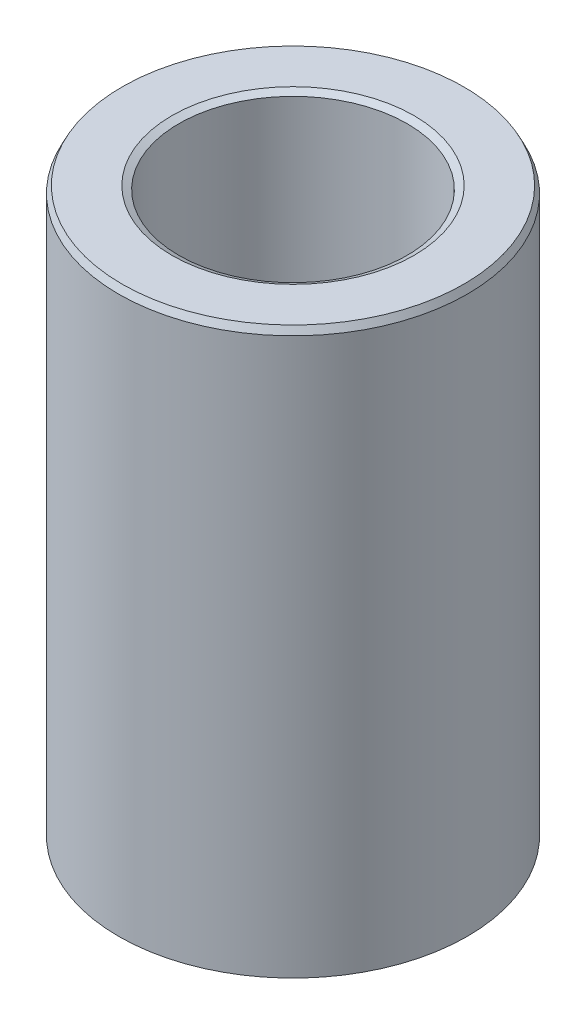
ISO-10303-21;
HEADER;
FILE_DESCRIPTION(('STEP AP214'),'2;1');
FILE_NAME('part.step','',(''),(''),'','','');
FILE_SCHEMA(('AUTOMOTIVE_DESIGN { 1 0 10303 214 1 1 1 1 }'));
ENDSEC;
DATA;
#1=APPLICATION_CONTEXT('core data for automotive mechanical design processes');
#2=APPLICATION_PROTOCOL_DEFINITION('international standard','automotive_design',2000,#1);
#3=PRODUCT_CONTEXT('',#1,'mechanical');
#4=PRODUCT('Part','Part','',(#3));
#5=PRODUCT_RELATED_PRODUCT_CATEGORY('part','',(#4));
#6=PRODUCT_DEFINITION_FORMATION('','',#4);
#7=PRODUCT_DEFINITION_CONTEXT('part definition',#1,'design');
#8=PRODUCT_DEFINITION('design','',#6,#7);
#9=PRODUCT_DEFINITION_SHAPE('','',#8);
#10=(LENGTH_UNIT() NAMED_UNIT(*) SI_UNIT(.MILLI.,.METRE.));
#11=(NAMED_UNIT(*) PLANE_ANGLE_UNIT() SI_UNIT($,.RADIAN.));
#12=(NAMED_UNIT(*) SI_UNIT($,.STERADIAN.) SOLID_ANGLE_UNIT());
#13=UNCERTAINTY_MEASURE_WITH_UNIT(LENGTH_MEASURE(1.E-05),#10,'distance_accuracy_value','');
#14=(GEOMETRIC_REPRESENTATION_CONTEXT(3) GLOBAL_UNCERTAINTY_ASSIGNED_CONTEXT((#13)) GLOBAL_UNIT_ASSIGNED_CONTEXT((#10,
#11,#12)) REPRESENTATION_CONTEXT('',''));
#15=CARTESIAN_POINT('',(0.,0.,0.));
#16=DIRECTION('',(0.,0.,1.));
#17=DIRECTION('',(1.,0.,0.));
#18=AXIS2_PLACEMENT_3D('',#15,#16,#17);
#19=CARTESIAN_POINT('',(0.,89.3773961884343,0.));
#20=DIRECTION('',(0.,-1.,0.));
#21=DIRECTION('',(0.,0.,-1.));
#22=AXIS2_PLACEMENT_3D('',#19,#20,#21);
#23=CYLINDRICAL_SURFACE('',#22,27.5);
#24=CARTESIAN_POINT('',(0.,0.546437469044203,0.));
#25=DIRECTION('',(0.,1.,0.));
#26=DIRECTION('',(0.,0.,1.));
#27=AXIS2_PLACEMENT_3D('',#24,#25,#26);
#28=CIRCLE('',#27,27.5);
#29=CARTESIAN_POINT('',(0.,0.546437469044203,27.5));
#30=VERTEX_POINT('',#29);
#31=EDGE_CURVE('E10',#30,#30,#28,.T.);
#32=ORIENTED_EDGE('',*,*,#31,.T.);
#33=EDGE_LOOP('',(#32));
#34=FACE_BOUND('',#33,.T.);
#35=CARTESIAN_POINT('',(0.,88.2854656453538,0.));
#36=DIRECTION('',(0.,1.,0.));
#37=DIRECTION('',(0.,0.,1.));
#38=AXIS2_PLACEMENT_3D('',#35,#36,#37);
#39=CIRCLE('',#38,27.5);
#40=CARTESIAN_POINT('',(0.,88.2854656453538,27.5));
#41=VERTEX_POINT('',#40);
#42=EDGE_CURVE('E50',#41,#41,#39,.F.);
#43=ORIENTED_EDGE('',*,*,#42,.T.);
#44=EDGE_LOOP('',(#43));
#45=FACE_BOUND('',#44,.T.);
#46=ADVANCED_FACE('F39',(#34,#45),#23,.T.);
#47=CARTESIAN_POINT('',(0.,89.3773961884343,0.));
#48=DIRECTION('',(0.,1.,0.));
#49=DIRECTION('',(0.,0.,1.));
#50=AXIS2_PLACEMENT_3D('',#47,#48,#49);
#51=PLANE('',#50);
#52=CARTESIAN_POINT('',(0.,89.3773961884343,0.));
#53=DIRECTION('',(0.,1.,0.));
#54=DIRECTION('',(0.,0.,1.));
#55=AXIS2_PLACEMENT_3D('',#52,#53,#54);
#56=CIRCLE('',#55,19.0959943513304);
#57=CARTESIAN_POINT('',(0.,89.3773961884343,19.0959943513304));
#58=VERTEX_POINT('',#57);
#59=EDGE_CURVE('E58',#58,#58,#56,.F.);
#60=ORIENTED_EDGE('',*,*,#59,.T.);
#61=EDGE_LOOP('',(#60));
#62=FACE_BOUND('',#61,.T.);
#63=CARTESIAN_POINT('',(0.,89.3773961884343,0.));
#64=DIRECTION('',(0.,1.,0.));
#65=DIRECTION('',(0.,0.,1.));
#66=AXIS2_PLACEMENT_3D('',#63,#64,#65);
#67=CIRCLE('',#66,26.9535625309558);
#68=CARTESIAN_POINT('',(0.,89.3773961884343,26.9535625309558));
#69=VERTEX_POINT('',#68);
#70=EDGE_CURVE('E61',#69,#69,#67,.T.);
#71=ORIENTED_EDGE('',*,*,#70,.T.);
#72=EDGE_LOOP('',(#71));
#73=FACE_BOUND('',#72,.T.);
#74=ADVANCED_FACE('F88',(#62,#73),#51,.T.);
#75=CARTESIAN_POINT('',(0.,0.,0.));
#76=DIRECTION('',(0.,1.,0.));
#77=DIRECTION('',(0.,0.,1.));
#78=AXIS2_PLACEMENT_3D('',#75,#76,#77);
#79=PLANE('',#78);
#80=CARTESIAN_POINT('',(0.,0.,0.));
#81=DIRECTION('',(0.,1.,0.));
#82=DIRECTION('',(0.,0.,1.));
#83=AXIS2_PLACEMENT_3D('',#80,#81,#82);
#84=CIRCLE('',#83,18.5505012772941);
#85=CARTESIAN_POINT('',(0.,0.,18.5505012772941));
#86=VERTEX_POINT('',#85);
#87=EDGE_CURVE('E51',#86,#86,#84,.T.);
#88=ORIENTED_EDGE('',*,*,#87,.T.);
#89=EDGE_LOOP('',(#88));
#90=FACE_BOUND('',#89,.T.);
#91=CARTESIAN_POINT('',(0.,0.,0.));
#92=DIRECTION('',(0.,1.,0.));
#93=DIRECTION('',(0.,0.,1.));
#94=AXIS2_PLACEMENT_3D('',#91,#92,#93);
#95=CIRCLE('',#94,26.4080694569194);
#96=CARTESIAN_POINT('',(0.,0.,26.4080694569194));
#97=VERTEX_POINT('',#96);
#98=EDGE_CURVE('E54',#97,#97,#95,.F.);
#99=ORIENTED_EDGE('',*,*,#98,.T.);
#100=EDGE_LOOP('',(#99));
#101=FACE_BOUND('',#100,.T.);
#102=ADVANCED_FACE('F83',(#90,#101),#79,.F.);
#103=CARTESIAN_POINT('',(0.,89.3773961884343,0.));
#104=DIRECTION('',(0.,-1.,0.));
#105=DIRECTION('',(0.,0.,-1.));
#106=AXIS2_PLACEMENT_3D('',#103,#104,#105);
#107=CYLINDRICAL_SURFACE('',#106,18.0040638082499);
#108=CARTESIAN_POINT('',(0.,88.8309587193901,0.));
#109=DIRECTION('',(0.,1.,0.));
#110=DIRECTION('',(0.,0.,1.));
#111=AXIS2_PLACEMENT_3D('',#108,#109,#110);
#112=CIRCLE('',#111,18.0040638082499);
#113=CARTESIAN_POINT('',(0.,88.8309587193901,18.0040638082499));
#114=VERTEX_POINT('',#113);
#115=EDGE_CURVE('E67',#114,#114,#112,.T.);
#116=ORIENTED_EDGE('',*,*,#115,.T.);
#117=EDGE_LOOP('',(#116));
#118=FACE_BOUND('',#117,.T.);
#119=CARTESIAN_POINT('',(0.,1.09193054308054,0.));
#120=DIRECTION('',(0.,1.,0.));
#121=DIRECTION('',(0.,0.,1.));
#122=AXIS2_PLACEMENT_3D('',#119,#120,#121);
#123=CIRCLE('',#122,18.0040638082499);
#124=CARTESIAN_POINT('',(0.,1.09193054308054,18.0040638082499));
#125=VERTEX_POINT('',#124);
#126=EDGE_CURVE('E69',#125,#125,#123,.F.);
#127=ORIENTED_EDGE('',*,*,#126,.T.);
#128=EDGE_LOOP('',(#127));
#129=FACE_BOUND('',#128,.T.);
#130=ADVANCED_FACE('F71',(#118,#129),#107,.F.);
#131=CARTESIAN_POINT('',(0.,88.8309587193901,0.));
#132=DIRECTION('',(0.,1.,0.));
#133=DIRECTION('',(0.,0.,1.));
#134=AXIS2_PLACEMENT_3D('',#131,#132,#133);
#135=CONICAL_SURFACE('',#134,18.0040638082499,1.1068028233979);
#136=ORIENTED_EDGE('',*,*,#59,.F.);
#137=EDGE_LOOP('',(#136));
#138=FACE_BOUND('',#137,.T.);
#139=ORIENTED_EDGE('',*,*,#115,.F.);
#140=EDGE_LOOP('',(#139));
#141=FACE_BOUND('',#140,.T.);
#142=ADVANCED_FACE('F77',(#138,#141),#135,.F.);
#143=CARTESIAN_POINT('',(0.,0.,0.));
#144=DIRECTION('',(0.,-1.,0.));
#145=DIRECTION('',(0.,0.,-1.));
#146=AXIS2_PLACEMENT_3D('',#143,#144,#145);
#147=CONICAL_SURFACE('',#146,18.5505012772941,0.463993503396991);
#148=ORIENTED_EDGE('',*,*,#126,.F.);
#149=EDGE_LOOP('',(#148));
#150=FACE_BOUND('',#149,.T.);
#151=ORIENTED_EDGE('',*,*,#87,.F.);
#152=EDGE_LOOP('',(#151));
#153=FACE_BOUND('',#152,.T.);
#154=ADVANCED_FACE('F73',(#150,#153),#147,.F.);
#155=CARTESIAN_POINT('',(0.,0.546437469044203,0.));
#156=DIRECTION('',(0.,1.,0.));
#157=DIRECTION('',(0.,0.,1.));
#158=AXIS2_PLACEMENT_3D('',#155,#156,#157);
#159=CONICAL_SURFACE('',#158,27.5,1.10680282339791);
#160=ORIENTED_EDGE('',*,*,#98,.F.);
#161=EDGE_LOOP('',(#160));
#162=FACE_BOUND('',#161,.T.);
#163=ORIENTED_EDGE('',*,*,#31,.F.);
#164=EDGE_LOOP('',(#163));
#165=FACE_BOUND('',#164,.T.);
#166=ADVANCED_FACE('F76',(#162,#165),#159,.T.);
#167=CARTESIAN_POINT('',(0.,89.3773961884343,0.));
#168=DIRECTION('',(0.,-1.,0.));
#169=DIRECTION('',(0.,0.,-1.));
#170=AXIS2_PLACEMENT_3D('',#167,#168,#169);
#171=CONICAL_SURFACE('',#170,26.9535625309558,0.463993503396989);
#172=ORIENTED_EDGE('',*,*,#42,.F.);
#173=EDGE_LOOP('',(#172));
#174=FACE_BOUND('',#173,.T.);
#175=ORIENTED_EDGE('',*,*,#70,.F.);
#176=EDGE_LOOP('',(#175));
#177=FACE_BOUND('',#176,.T.);
#178=ADVANCED_FACE('F45',(#174,#177),#171,.T.);
#179=CLOSED_SHELL('',(#46,#74,#102,#130,#142,#154,#166,#178));
#180=MANIFOLD_SOLID_BREP('B2',#179);
#181=ADVANCED_BREP_SHAPE_REPRESENTATION('',(#18,#180),#14);
#182=SHAPE_DEFINITION_REPRESENTATION(#9,#181);
ENDSEC;
END-ISO-10303-21;
